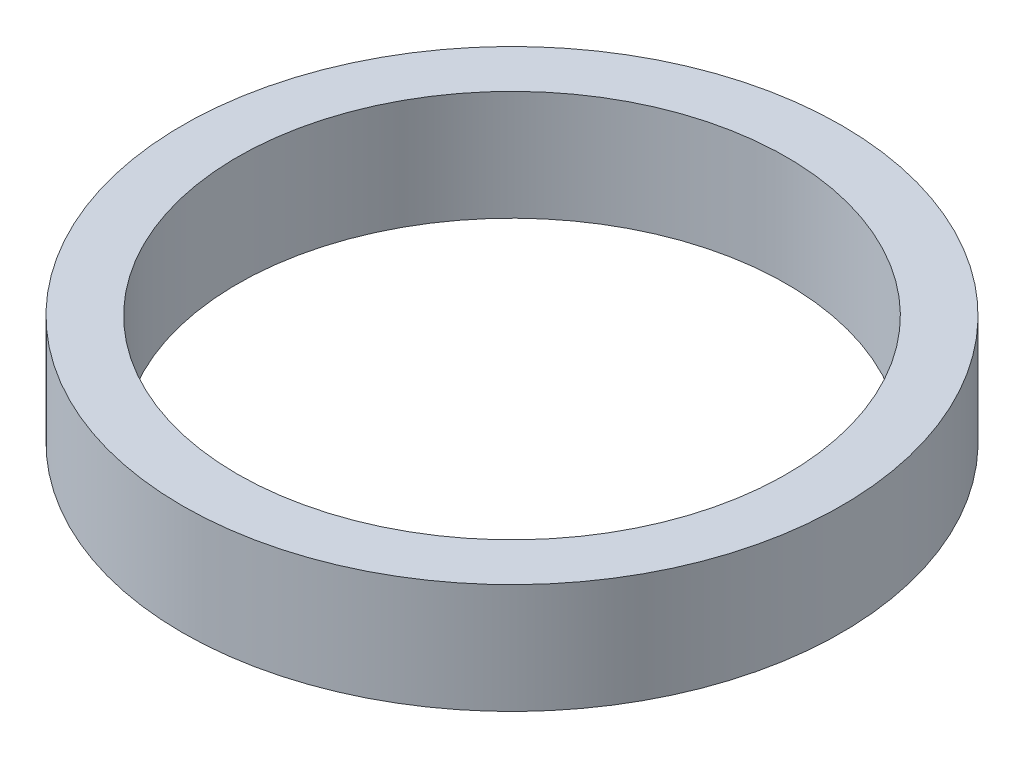
ISO-10303-21;
HEADER;
FILE_DESCRIPTION(('STEP AP214'),'2;1');
FILE_NAME('part.step','',(''),(''),'','','');
FILE_SCHEMA(('AUTOMOTIVE_DESIGN { 1 0 10303 214 1 1 1 1 }'));
ENDSEC;
DATA;
#1=APPLICATION_CONTEXT('core data for automotive mechanical design processes');
#2=APPLICATION_PROTOCOL_DEFINITION('international standard','automotive_design',2000,#1);
#3=PRODUCT_CONTEXT('',#1,'mechanical');
#4=PRODUCT('Part','Part','',(#3));
#5=PRODUCT_RELATED_PRODUCT_CATEGORY('part','',(#4));
#6=PRODUCT_DEFINITION_FORMATION('','',#4);
#7=PRODUCT_DEFINITION_CONTEXT('part definition',#1,'design');
#8=PRODUCT_DEFINITION('design','',#6,#7);
#9=PRODUCT_DEFINITION_SHAPE('','',#8);
#10=(LENGTH_UNIT() NAMED_UNIT(*) SI_UNIT(.MILLI.,.METRE.));
#11=(NAMED_UNIT(*) PLANE_ANGLE_UNIT() SI_UNIT($,.RADIAN.));
#12=(NAMED_UNIT(*) SI_UNIT($,.STERADIAN.) SOLID_ANGLE_UNIT());
#13=UNCERTAINTY_MEASURE_WITH_UNIT(LENGTH_MEASURE(1.E-05),#10,'distance_accuracy_value','');
#14=(GEOMETRIC_REPRESENTATION_CONTEXT(3) GLOBAL_UNCERTAINTY_ASSIGNED_CONTEXT((#13)) GLOBAL_UNIT_ASSIGNED_CONTEXT((#10,
#11,#12)) REPRESENTATION_CONTEXT('',''));
#15=CARTESIAN_POINT('',(0.,0.,0.));
#16=DIRECTION('',(0.,0.,1.));
#17=DIRECTION('',(1.,0.,0.));
#18=AXIS2_PLACEMENT_3D('',#15,#16,#17);
#19=CARTESIAN_POINT('',(0.,15.,0.));
#20=DIRECTION('',(0.,-1.,0.));
#21=DIRECTION('',(0.,0.,-1.));
#22=AXIS2_PLACEMENT_3D('',#19,#20,#21);
#23=CYLINDRICAL_SURFACE('',#22,45.);
#24=CARTESIAN_POINT('',(0.,15.,0.));
#25=DIRECTION('',(0.,1.,0.));
#26=DIRECTION('',(0.,0.,1.));
#27=AXIS2_PLACEMENT_3D('',#24,#25,#26);
#28=CIRCLE('',#27,45.);
#29=CARTESIAN_POINT('',(0.,15.,45.));
#30=VERTEX_POINT('',#29);
#31=EDGE_CURVE('E10',#30,#30,#28,.T.);
#32=ORIENTED_EDGE('',*,*,#31,.F.);
#33=EDGE_LOOP('',(#32));
#34=FACE_BOUND('',#33,.T.);
#35=CARTESIAN_POINT('',(0.,0.,0.));
#36=DIRECTION('',(0.,1.,0.));
#37=DIRECTION('',(0.,0.,1.));
#38=AXIS2_PLACEMENT_3D('',#35,#36,#37);
#39=CIRCLE('',#38,45.);
#40=CARTESIAN_POINT('',(0.,0.,45.));
#41=VERTEX_POINT('',#40);
#42=EDGE_CURVE('E37',#41,#41,#39,.T.);
#43=ORIENTED_EDGE('',*,*,#42,.T.);
#44=EDGE_LOOP('',(#43));
#45=FACE_BOUND('',#44,.T.);
#46=ADVANCED_FACE('F40',(#34,#45),#23,.T.);
#47=CARTESIAN_POINT('',(0.,15.,0.));
#48=DIRECTION('',(0.,1.,0.));
#49=DIRECTION('',(0.,0.,1.));
#50=AXIS2_PLACEMENT_3D('',#47,#48,#49);
#51=PLANE('',#50);
#52=CARTESIAN_POINT('',(0.,15.,0.));
#53=DIRECTION('',(0.,1.,0.));
#54=DIRECTION('',(0.,0.,1.));
#55=AXIS2_PLACEMENT_3D('',#52,#53,#54);
#56=CIRCLE('',#55,37.5);
#57=CARTESIAN_POINT('',(0.,15.,37.5));
#58=VERTEX_POINT('',#57);
#59=EDGE_CURVE('E50',#58,#58,#56,.T.);
#60=ORIENTED_EDGE('',*,*,#59,.F.);
#61=EDGE_LOOP('',(#60));
#62=FACE_BOUND('',#61,.T.);
#63=ORIENTED_EDGE('',*,*,#31,.T.);
#64=EDGE_LOOP('',(#63));
#65=FACE_BOUND('',#64,.T.);
#66=ADVANCED_FACE('F59',(#62,#65),#51,.T.);
#67=CARTESIAN_POINT('',(0.,0.,0.));
#68=DIRECTION('',(0.,1.,0.));
#69=DIRECTION('',(0.,0.,1.));
#70=AXIS2_PLACEMENT_3D('',#67,#68,#69);
#71=PLANE('',#70);
#72=CARTESIAN_POINT('',(0.,0.,0.));
#73=DIRECTION('',(0.,1.,0.));
#74=DIRECTION('',(0.,0.,1.));
#75=AXIS2_PLACEMENT_3D('',#72,#73,#74);
#76=CIRCLE('',#75,37.5);
#77=CARTESIAN_POINT('',(0.,0.,37.5));
#78=VERTEX_POINT('',#77);
#79=EDGE_CURVE('E47',#78,#78,#76,.T.);
#80=ORIENTED_EDGE('',*,*,#79,.T.);
#81=EDGE_LOOP('',(#80));
#82=FACE_BOUND('',#81,.T.);
#83=ORIENTED_EDGE('',*,*,#42,.F.);
#84=EDGE_LOOP('',(#83));
#85=FACE_BOUND('',#84,.T.);
#86=ADVANCED_FACE('F58',(#82,#85),#71,.F.);
#87=CARTESIAN_POINT('',(0.,15.,0.));
#88=DIRECTION('',(0.,-1.,0.));
#89=DIRECTION('',(0.,0.,-1.));
#90=AXIS2_PLACEMENT_3D('',#87,#88,#89);
#91=CYLINDRICAL_SURFACE('',#90,37.5);
#92=ORIENTED_EDGE('',*,*,#59,.T.);
#93=EDGE_LOOP('',(#92));
#94=FACE_BOUND('',#93,.T.);
#95=ORIENTED_EDGE('',*,*,#79,.F.);
#96=EDGE_LOOP('',(#95));
#97=FACE_BOUND('',#96,.T.);
#98=ADVANCED_FACE('F54',(#94,#97),#91,.F.);
#99=CLOSED_SHELL('',(#46,#66,#86,#98));
#100=MANIFOLD_SOLID_BREP('B2',#99);
#101=ADVANCED_BREP_SHAPE_REPRESENTATION('',(#18,#100),#14);
#102=SHAPE_DEFINITION_REPRESENTATION(#9,#101);
ENDSEC;
END-ISO-10303-21;
